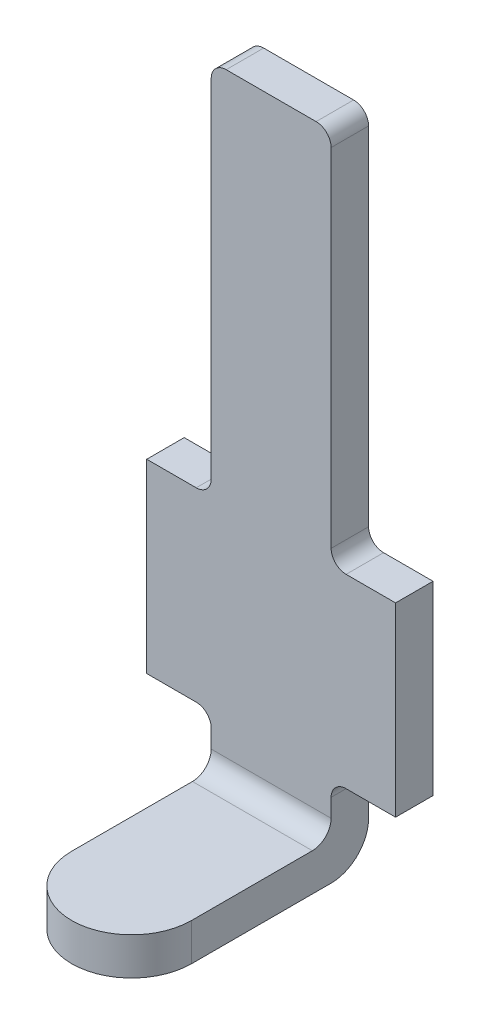
ISO-10303-21;
HEADER;
FILE_DESCRIPTION(('STEP AP214'),'2;1');
FILE_NAME('part.step','',(''),(''),'','','');
FILE_SCHEMA(('AUTOMOTIVE_DESIGN { 1 0 10303 214 1 1 1 1 }'));
ENDSEC;
DATA;
#1=APPLICATION_CONTEXT('core data for automotive mechanical design processes');
#2=APPLICATION_PROTOCOL_DEFINITION('international standard','automotive_design',2000,#1);
#3=PRODUCT_CONTEXT('',#1,'mechanical');
#4=PRODUCT('Part','Part','',(#3));
#5=PRODUCT_RELATED_PRODUCT_CATEGORY('part','',(#4));
#6=PRODUCT_DEFINITION_FORMATION('','',#4);
#7=PRODUCT_DEFINITION_CONTEXT('part definition',#1,'design');
#8=PRODUCT_DEFINITION('design','',#6,#7);
#9=PRODUCT_DEFINITION_SHAPE('','',#8);
#10=(LENGTH_UNIT() NAMED_UNIT(*) SI_UNIT(.MILLI.,.METRE.));
#11=(NAMED_UNIT(*) PLANE_ANGLE_UNIT() SI_UNIT($,.RADIAN.));
#12=(NAMED_UNIT(*) SI_UNIT($,.STERADIAN.) SOLID_ANGLE_UNIT());
#13=UNCERTAINTY_MEASURE_WITH_UNIT(LENGTH_MEASURE(1.E-05),#10,'distance_accuracy_value','');
#14=(GEOMETRIC_REPRESENTATION_CONTEXT(3) GLOBAL_UNCERTAINTY_ASSIGNED_CONTEXT((#13)) GLOBAL_UNIT_ASSIGNED_CONTEXT((#10,
#11,#12)) REPRESENTATION_CONTEXT('',''));
#15=CARTESIAN_POINT('',(0.,0.,0.));
#16=DIRECTION('',(0.,0.,1.));
#17=DIRECTION('',(1.,0.,0.));
#18=AXIS2_PLACEMENT_3D('',#15,#16,#17);
#19=CARTESIAN_POINT('',(10.93,1.48437551370885,0.748999999999983));
#20=DIRECTION('',(0.,0.,1.));
#21=DIRECTION('',(1.,0.,0.));
#22=AXIS2_PLACEMENT_3D('',#19,#20,#21);
#23=CYLINDRICAL_SURFACE('',#22,0.1);
#24=CARTESIAN_POINT('',(10.93,1.48437551370885,0.498999999999983));
#25=DIRECTION('',(0.,0.,1.));
#26=DIRECTION('',(1.,0.,0.));
#27=AXIS2_PLACEMENT_3D('',#24,#25,#26);
#28=CIRCLE('',#27,0.1);
#29=CARTESIAN_POINT('',(10.93,1.38437551370885,0.499000000000012));
#30=VERTEX_POINT('',#29);
#31=CARTESIAN_POINT('',(11.03,1.48437551370885,0.498999999999983));
#32=VERTEX_POINT('',#31);
#33=EDGE_CURVE('E331',#30,#32,#28,.T.);
#34=ORIENTED_EDGE('',*,*,#33,.F.);
#35=DIRECTION('',(0.,0.,-1.));
#36=VECTOR('',#35,1.);
#37=CARTESIAN_POINT('',(10.93,1.38437551370885,0.749000000000012));
#38=LINE('',#37,#36);
#39=CARTESIAN_POINT('',(10.93,1.38437551370885,0.749000000000012));
#40=VERTEX_POINT('',#39);
#41=EDGE_CURVE('E41',#40,#30,#38,.T.);
#42=ORIENTED_EDGE('',*,*,#41,.F.);
#43=CARTESIAN_POINT('',(10.93,1.48437551370885,0.748999999999983));
#44=DIRECTION('',(0.,0.,-1.));
#45=DIRECTION('',(-1.,0.,0.));
#46=AXIS2_PLACEMENT_3D('',#43,#44,#45);
#47=CIRCLE('',#46,0.1);
#48=CARTESIAN_POINT('',(11.03,1.48437551370885,0.748999999999983));
#49=VERTEX_POINT('',#48);
#50=EDGE_CURVE('E254',#49,#40,#47,.T.);
#51=ORIENTED_EDGE('',*,*,#50,.F.);
#52=DIRECTION('',(0.,0.,1.));
#53=VECTOR('',#52,1.);
#54=CARTESIAN_POINT('',(11.03,1.48437551370885,0.748999999999983));
#55=LINE('',#54,#53);
#56=EDGE_CURVE('E300',#32,#49,#55,.T.);
#57=ORIENTED_EDGE('',*,*,#56,.F.);
#58=EDGE_LOOP('',(#34,#42,#51,#57));
#59=FACE_BOUND('',#58,.T.);
#60=ADVANCED_FACE('F16',(#59),#23,.F.);
#61=CARTESIAN_POINT('',(11.93,1.48437551370885,0.749000000000014));
#62=DIRECTION('',(0.,0.,-1.));
#63=DIRECTION('',(-1.,0.,0.));
#64=AXIS2_PLACEMENT_3D('',#61,#62,#63);
#65=CYLINDRICAL_SURFACE('',#64,0.1);
#66=CARTESIAN_POINT('',(11.93,1.48437551370885,0.498999999999985));
#67=DIRECTION('',(0.,0.,1.));
#68=DIRECTION('',(1.,0.,0.));
#69=AXIS2_PLACEMENT_3D('',#66,#67,#68);
#70=CIRCLE('',#69,0.1);
#71=CARTESIAN_POINT('',(11.83,1.48437551370885,0.498999999999984));
#72=VERTEX_POINT('',#71);
#73=CARTESIAN_POINT('',(11.93,1.38437551370885,0.499000000000013));
#74=VERTEX_POINT('',#73);
#75=EDGE_CURVE('E275',#72,#74,#70,.T.);
#76=ORIENTED_EDGE('',*,*,#75,.F.);
#77=DIRECTION('',(0.,0.,-1.));
#78=VECTOR('',#77,1.);
#79=CARTESIAN_POINT('',(11.83,1.48437551370885,0.498999999999984));
#80=LINE('',#79,#78);
#81=CARTESIAN_POINT('',(11.83,1.48437551370885,0.748999999999984));
#82=VERTEX_POINT('',#81);
#83=EDGE_CURVE('E294',#82,#72,#80,.T.);
#84=ORIENTED_EDGE('',*,*,#83,.F.);
#85=CARTESIAN_POINT('',(11.93,1.48437551370885,0.748999999999984));
#86=DIRECTION('',(0.,0.,-1.));
#87=DIRECTION('',(-1.,0.,0.));
#88=AXIS2_PLACEMENT_3D('',#85,#86,#87);
#89=CIRCLE('',#88,0.1);
#90=CARTESIAN_POINT('',(11.93,1.38437551370885,0.749000000000014));
#91=VERTEX_POINT('',#90);
#92=EDGE_CURVE('E385',#91,#82,#89,.T.);
#93=ORIENTED_EDGE('',*,*,#92,.F.);
#94=DIRECTION('',(0.,0.,1.));
#95=VECTOR('',#94,1.);
#96=CARTESIAN_POINT('',(11.93,1.38437551370885,0.748999999999984));
#97=LINE('',#96,#95);
#98=EDGE_CURVE('E327',#74,#91,#97,.T.);
#99=ORIENTED_EDGE('',*,*,#98,.F.);
#100=EDGE_LOOP('',(#76,#84,#93,#99));
#101=FACE_BOUND('',#100,.T.);
#102=ADVANCED_FACE('F770',(#101),#65,.F.);
#103=CARTESIAN_POINT('',(10.93,0.0459658151929143,0.749000000000012));
#104=DIRECTION('',(0.,0.,-1.));
#105=DIRECTION('',(-1.,0.,0.));
#106=AXIS2_PLACEMENT_3D('',#103,#104,#105);
#107=CYLINDRICAL_SURFACE('',#106,0.1);
#108=CARTESIAN_POINT('',(10.93,0.0459658151929143,0.498999999999983));
#109=DIRECTION('',(0.,0.,1.));
#110=DIRECTION('',(1.,0.,0.));
#111=AXIS2_PLACEMENT_3D('',#108,#109,#110);
#112=CIRCLE('',#111,0.1);
#113=CARTESIAN_POINT('',(11.03,0.0459658151929143,0.498999999999983));
#114=VERTEX_POINT('',#113);
#115=CARTESIAN_POINT('',(10.93,0.145965815192914,0.499000000000012));
#116=VERTEX_POINT('',#115);
#117=EDGE_CURVE('E401',#114,#116,#112,.T.);
#118=ORIENTED_EDGE('',*,*,#117,.F.);
#119=DIRECTION('',(0.,0.,-1.));
#120=VECTOR('',#119,1.);
#121=CARTESIAN_POINT('',(11.03,0.0459658151929143,0.499000000000012));
#122=LINE('',#121,#120);
#123=CARTESIAN_POINT('',(11.03,0.0459658151929143,0.748999999999983));
#124=VERTEX_POINT('',#123);
#125=EDGE_CURVE('E88',#124,#114,#122,.T.);
#126=ORIENTED_EDGE('',*,*,#125,.F.);
#127=CARTESIAN_POINT('',(10.93,0.0459658151929143,0.748999999999983));
#128=DIRECTION('',(0.,0.,-1.));
#129=DIRECTION('',(-1.,0.,0.));
#130=AXIS2_PLACEMENT_3D('',#127,#128,#129);
#131=CIRCLE('',#130,0.1);
#132=CARTESIAN_POINT('',(10.93,0.145965815192914,0.749000000000012));
#133=VERTEX_POINT('',#132);
#134=EDGE_CURVE('E241',#133,#124,#131,.T.);
#135=ORIENTED_EDGE('',*,*,#134,.F.);
#136=DIRECTION('',(0.,0.,1.));
#137=VECTOR('',#136,1.);
#138=CARTESIAN_POINT('',(10.93,0.145965815192914,0.748999999999983));
#139=LINE('',#138,#137);
#140=EDGE_CURVE('E231',#116,#133,#139,.T.);
#141=ORIENTED_EDGE('',*,*,#140,.F.);
#142=EDGE_LOOP('',(#118,#126,#135,#141));
#143=FACE_BOUND('',#142,.T.);
#144=ADVANCED_FACE('F447',(#143),#107,.F.);
#145=CARTESIAN_POINT('',(11.93,0.0459658151929143,0.748999999999984));
#146=DIRECTION('',(0.,0.,1.));
#147=DIRECTION('',(1.,0.,0.));
#148=AXIS2_PLACEMENT_3D('',#145,#146,#147);
#149=CYLINDRICAL_SURFACE('',#148,0.1);
#150=CARTESIAN_POINT('',(11.93,0.0459658151929143,0.498999999999984));
#151=DIRECTION('',(0.,0.,1.));
#152=DIRECTION('',(1.,0.,0.));
#153=AXIS2_PLACEMENT_3D('',#150,#151,#152);
#154=CIRCLE('',#153,0.1);
#155=CARTESIAN_POINT('',(11.93,0.145965815192914,0.499000000000013));
#156=VERTEX_POINT('',#155);
#157=CARTESIAN_POINT('',(11.83,0.0459658151929143,0.498999999999984));
#158=VERTEX_POINT('',#157);
#159=EDGE_CURVE('E271',#156,#158,#154,.T.);
#160=ORIENTED_EDGE('',*,*,#159,.F.);
#161=DIRECTION('',(0.,0.,-1.));
#162=VECTOR('',#161,1.);
#163=CARTESIAN_POINT('',(11.93,0.145965815192914,0.749000000000013));
#164=LINE('',#163,#162);
#165=CARTESIAN_POINT('',(11.93,0.145965815192914,0.749000000000013));
#166=VERTEX_POINT('',#165);
#167=EDGE_CURVE('E26',#166,#156,#164,.T.);
#168=ORIENTED_EDGE('',*,*,#167,.F.);
#169=CARTESIAN_POINT('',(11.93,0.0459658151929143,0.748999999999984));
#170=DIRECTION('',(0.,0.,-1.));
#171=DIRECTION('',(-1.,0.,0.));
#172=AXIS2_PLACEMENT_3D('',#169,#170,#171);
#173=CIRCLE('',#172,0.1);
#174=CARTESIAN_POINT('',(11.83,0.0459658151929143,0.748999999999984));
#175=VERTEX_POINT('',#174);
#176=EDGE_CURVE('E310',#175,#166,#173,.T.);
#177=ORIENTED_EDGE('',*,*,#176,.F.);
#178=DIRECTION('',(0.,0.,1.));
#179=VECTOR('',#178,1.);
#180=CARTESIAN_POINT('',(11.83,0.0459658151929143,0.748999999999984));
#181=LINE('',#180,#179);
#182=EDGE_CURVE('E105',#158,#175,#181,.T.);
#183=ORIENTED_EDGE('',*,*,#182,.F.);
#184=EDGE_LOOP('',(#160,#168,#177,#183));
#185=FACE_BOUND('',#184,.T.);
#186=ADVANCED_FACE('F754',(#185),#149,.F.);
#187=CARTESIAN_POINT('',(11.13,3.8,0.748999999999983));
#188=DIRECTION('',(0.,0.,-1.));
#189=DIRECTION('',(-1.,0.,0.));
#190=AXIS2_PLACEMENT_3D('',#187,#188,#189);
#191=CYLINDRICAL_SURFACE('',#190,0.1);
#192=CARTESIAN_POINT('',(11.13,3.8,0.498999999999984));
#193=DIRECTION('',(0.,0.,-1.));
#194=DIRECTION('',(1.,0.,0.));
#195=AXIS2_PLACEMENT_3D('',#192,#193,#194);
#196=CIRCLE('',#195,0.1);
#197=CARTESIAN_POINT('',(11.03,3.8,0.498999999999984));
#198=VERTEX_POINT('',#197);
#199=CARTESIAN_POINT('',(11.13,3.9,0.498999999999984));
#200=VERTEX_POINT('',#199);
#201=EDGE_CURVE('E328',#198,#200,#196,.T.);
#202=ORIENTED_EDGE('',*,*,#201,.F.);
#203=DIRECTION('',(0.,0.,-1.));
#204=VECTOR('',#203,1.);
#205=CARTESIAN_POINT('',(11.03,3.8,0.498999999999984));
#206=LINE('',#205,#204);
#207=CARTESIAN_POINT('',(11.03,3.8,0.748999999999983));
#208=VERTEX_POINT('',#207);
#209=EDGE_CURVE('E346',#208,#198,#206,.T.);
#210=ORIENTED_EDGE('',*,*,#209,.F.);
#211=CARTESIAN_POINT('',(11.13,3.8,0.748999999999983));
#212=DIRECTION('',(0.,0.,1.));
#213=DIRECTION('',(-1.,0.,0.));
#214=AXIS2_PLACEMENT_3D('',#211,#212,#213);
#215=CIRCLE('',#214,0.1);
#216=CARTESIAN_POINT('',(11.13,3.9,0.748999999999983));
#217=VERTEX_POINT('',#216);
#218=EDGE_CURVE('E360',#217,#208,#215,.T.);
#219=ORIENTED_EDGE('',*,*,#218,.F.);
#220=DIRECTION('',(0.,0.,1.));
#221=VECTOR('',#220,1.);
#222=CARTESIAN_POINT('',(11.13,3.9,0.748999999999983));
#223=LINE('',#222,#221);
#224=EDGE_CURVE('E262',#200,#217,#223,.T.);
#225=ORIENTED_EDGE('',*,*,#224,.F.);
#226=EDGE_LOOP('',(#202,#210,#219,#225));
#227=FACE_BOUND('',#226,.T.);
#228=ADVANCED_FACE('F737',(#227),#191,.T.);
#229=CARTESIAN_POINT('',(11.73,3.8,0.748999999999984));
#230=DIRECTION('',(0.,0.,1.));
#231=DIRECTION('',(1.,0.,0.));
#232=AXIS2_PLACEMENT_3D('',#229,#230,#231);
#233=CYLINDRICAL_SURFACE('',#232,0.1);
#234=CARTESIAN_POINT('',(11.73,3.8,0.498999999999985));
#235=DIRECTION('',(0.,0.,-1.));
#236=DIRECTION('',(1.,0.,0.));
#237=AXIS2_PLACEMENT_3D('',#234,#235,#236);
#238=CIRCLE('',#237,0.1);
#239=CARTESIAN_POINT('',(11.73,3.9,0.498999999999985));
#240=VERTEX_POINT('',#239);
#241=CARTESIAN_POINT('',(11.83,3.8,0.498999999999985));
#242=VERTEX_POINT('',#241);
#243=EDGE_CURVE('E272',#240,#242,#238,.T.);
#244=ORIENTED_EDGE('',*,*,#243,.F.);
#245=DIRECTION('',(0.,0.,-1.));
#246=VECTOR('',#245,1.);
#247=CARTESIAN_POINT('',(11.73,3.9,0.748999999999984));
#248=LINE('',#247,#246);
#249=CARTESIAN_POINT('',(11.73,3.9,0.748999999999984));
#250=VERTEX_POINT('',#249);
#251=EDGE_CURVE('E283',#250,#240,#248,.T.);
#252=ORIENTED_EDGE('',*,*,#251,.F.);
#253=CARTESIAN_POINT('',(11.73,3.8,0.748999999999984));
#254=DIRECTION('',(0.,0.,1.));
#255=DIRECTION('',(-1.,0.,0.));
#256=AXIS2_PLACEMENT_3D('',#253,#254,#255);
#257=CIRCLE('',#256,0.1);
#258=CARTESIAN_POINT('',(11.83,3.8,0.748999999999984));
#259=VERTEX_POINT('',#258);
#260=EDGE_CURVE('E266',#259,#250,#257,.T.);
#261=ORIENTED_EDGE('',*,*,#260,.F.);
#262=DIRECTION('',(0.,0.,1.));
#263=VECTOR('',#262,1.);
#264=CARTESIAN_POINT('',(11.83,3.8,0.748999999999984));
#265=LINE('',#264,#263);
#266=EDGE_CURVE('E314',#242,#259,#265,.T.);
#267=ORIENTED_EDGE('',*,*,#266,.F.);
#268=EDGE_LOOP('',(#244,#252,#261,#267));
#269=FACE_BOUND('',#268,.T.);
#270=ADVANCED_FACE('F728',(#269),#233,.T.);
#271=CARTESIAN_POINT('',(12.26,0.,1.00308650274883E-13));
#272=DIRECTION('',(-1.,0.,0.));
#273=DIRECTION('',(0.,0.,1.));
#274=AXIS2_PLACEMENT_3D('',#271,#272,#273);
#275=PLANE('',#274);
#276=DIRECTION('',(0.,0.,-1.));
#277=VECTOR('',#276,1.);
#278=CARTESIAN_POINT('',(12.26,1.38437551370885,0.749000000000014));
#279=LINE('',#278,#277);
#280=CARTESIAN_POINT('',(12.26,1.38437551370885,0.749000000000014));
#281=VERTEX_POINT('',#280);
#282=CARTESIAN_POINT('',(12.26,1.38437551370885,0.499000000000014));
#283=VERTEX_POINT('',#282);
#284=EDGE_CURVE('E324',#281,#283,#279,.T.);
#285=ORIENTED_EDGE('',*,*,#284,.F.);
#286=DIRECTION('',(0.,-1.,0.));
#287=VECTOR('',#286,1.);
#288=CARTESIAN_POINT('',(12.26,1.38437551370885,0.749000000000014));
#289=LINE('',#288,#287);
#290=CARTESIAN_POINT('',(12.26,0.145965815192914,0.749000000000014));
#291=VERTEX_POINT('',#290);
#292=EDGE_CURVE('E309',#281,#291,#289,.T.);
#293=ORIENTED_EDGE('',*,*,#292,.T.);
#294=DIRECTION('',(0.,0.,-1.));
#295=VECTOR('',#294,1.);
#296=CARTESIAN_POINT('',(12.26,0.145965815192914,0.749000000000014));
#297=LINE('',#296,#295);
#298=CARTESIAN_POINT('',(12.26,0.145965815192914,0.499000000000014));
#299=VERTEX_POINT('',#298);
#300=EDGE_CURVE('E11',#291,#299,#297,.T.);
#301=ORIENTED_EDGE('',*,*,#300,.T.);
#302=DIRECTION('',(0.,-1.,0.));
#303=VECTOR('',#302,1.);
#304=CARTESIAN_POINT('',(12.26,1.38437551370885,0.499000000000014));
#305=LINE('',#304,#303);
#306=EDGE_CURVE('E277',#283,#299,#305,.T.);
#307=ORIENTED_EDGE('',*,*,#306,.F.);
#308=EDGE_LOOP('',(#285,#293,#301,#307));
#309=FACE_BOUND('',#308,.T.);
#310=ADVANCED_FACE('F616',(#309),#275,.F.);
#311=CARTESIAN_POINT('',(10.6,0.145965815192914,0.749000000000011));
#312=DIRECTION('',(0.,-1.,0.));
#313=DIRECTION('',(0.,0.,-1.));
#314=AXIS2_PLACEMENT_3D('',#311,#312,#313);
#315=PLANE('',#314);
#316=DIRECTION('',(1.,0.,0.));
#317=VECTOR('',#316,1.);
#318=CARTESIAN_POINT('',(10.6,0.145965815192914,0.749000000000011));
#319=LINE('',#318,#317);
#320=EDGE_CURVE('E305',#166,#291,#319,.T.);
#321=ORIENTED_EDGE('',*,*,#320,.F.);
#322=ORIENTED_EDGE('',*,*,#167,.T.);
#323=DIRECTION('',(1.,0.,0.));
#324=VECTOR('',#323,1.);
#325=CARTESIAN_POINT('',(10.6,0.145965815192914,0.499000000000011));
#326=LINE('',#325,#324);
#327=EDGE_CURVE('E280',#156,#299,#326,.T.);
#328=ORIENTED_EDGE('',*,*,#327,.T.);
#329=ORIENTED_EDGE('',*,*,#300,.F.);
#330=EDGE_LOOP('',(#321,#322,#328,#329));
#331=FACE_BOUND('',#330,.T.);
#332=ADVANCED_FACE('F611',(#331),#315,.T.);
#333=CARTESIAN_POINT('',(10.6,1.38437551370885,0.749000000000012));
#334=DIRECTION('',(0.,-1.,0.));
#335=DIRECTION('',(0.,0.,-1.));
#336=AXIS2_PLACEMENT_3D('',#333,#334,#335);
#337=PLANE('',#336);
#338=DIRECTION('',(1.,0.,0.));
#339=VECTOR('',#338,1.);
#340=CARTESIAN_POINT('',(10.6,1.38437551370885,0.499000000000011));
#341=LINE('',#340,#339);
#342=EDGE_CURVE('E281',#74,#283,#341,.T.);
#343=ORIENTED_EDGE('',*,*,#342,.F.);
#344=ORIENTED_EDGE('',*,*,#98,.T.);
#345=DIRECTION('',(1.,0.,0.));
#346=VECTOR('',#345,1.);
#347=CARTESIAN_POINT('',(10.6,1.38437551370885,0.749000000000012));
#348=LINE('',#347,#346);
#349=EDGE_CURVE('E388',#91,#281,#348,.T.);
#350=ORIENTED_EDGE('',*,*,#349,.T.);
#351=ORIENTED_EDGE('',*,*,#284,.T.);
#352=EDGE_LOOP('',(#343,#344,#350,#351));
#353=FACE_BOUND('',#352,.T.);
#354=ADVANCED_FACE('F615',(#353),#337,.F.);
#355=CARTESIAN_POINT('',(10.6,1.38437551370885,0.749000000000012));
#356=DIRECTION('',(0.,-1.,0.));
#357=DIRECTION('',(0.,0.,-1.));
#358=AXIS2_PLACEMENT_3D('',#355,#356,#357);
#359=PLANE('',#358);
#360=DIRECTION('',(1.,0.,0.));
#361=VECTOR('',#360,1.);
#362=CARTESIAN_POINT('',(10.6,1.38437551370885,0.749000000000012));
#363=LINE('',#362,#361);
#364=CARTESIAN_POINT('',(10.6,1.38437551370885,0.749000000000012));
#365=VERTEX_POINT('',#364);
#366=EDGE_CURVE('E246',#365,#40,#363,.T.);
#367=ORIENTED_EDGE('',*,*,#366,.T.);
#368=ORIENTED_EDGE('',*,*,#41,.T.);
#369=DIRECTION('',(1.,0.,0.));
#370=VECTOR('',#369,1.);
#371=CARTESIAN_POINT('',(10.6,1.38437551370885,0.499000000000011));
#372=LINE('',#371,#370);
#373=CARTESIAN_POINT('',(10.6,1.38437551370885,0.499000000000011));
#374=VERTEX_POINT('',#373);
#375=EDGE_CURVE('E339',#374,#30,#372,.T.);
#376=ORIENTED_EDGE('',*,*,#375,.F.);
#377=DIRECTION('',(0.,0.,-1.));
#378=VECTOR('',#377,1.);
#379=CARTESIAN_POINT('',(10.6,1.38437551370885,0.749000000000012));
#380=LINE('',#379,#378);
#381=EDGE_CURVE('E232',#365,#374,#380,.T.);
#382=ORIENTED_EDGE('',*,*,#381,.F.);
#383=EDGE_LOOP('',(#367,#368,#376,#382));
#384=FACE_BOUND('',#383,.T.);
#385=ADVANCED_FACE('F702',(#384),#359,.F.);
#386=CARTESIAN_POINT('',(10.6,0.145965815192914,0.749000000000011));
#387=DIRECTION('',(0.,-1.,0.));
#388=DIRECTION('',(0.,0.,-1.));
#389=AXIS2_PLACEMENT_3D('',#386,#387,#388);
#390=PLANE('',#389);
#391=DIRECTION('',(1.,0.,0.));
#392=VECTOR('',#391,1.);
#393=CARTESIAN_POINT('',(10.6,0.145965815192914,0.499000000000011));
#394=LINE('',#393,#392);
#395=CARTESIAN_POINT('',(10.6,0.145965815192914,0.499000000000011));
#396=VERTEX_POINT('',#395);
#397=EDGE_CURVE('E396',#396,#116,#394,.T.);
#398=ORIENTED_EDGE('',*,*,#397,.T.);
#399=ORIENTED_EDGE('',*,*,#140,.T.);
#400=DIRECTION('',(1.,0.,0.));
#401=VECTOR('',#400,1.);
#402=CARTESIAN_POINT('',(10.6,0.145965815192914,0.749000000000011));
#403=LINE('',#402,#401);
#404=CARTESIAN_POINT('',(10.6,0.145965815192914,0.749000000000011));
#405=VERTEX_POINT('',#404);
#406=EDGE_CURVE('E235',#405,#133,#403,.T.);
#407=ORIENTED_EDGE('',*,*,#406,.F.);
#408=DIRECTION('',(0.,0.,-1.));
#409=VECTOR('',#408,1.);
#410=CARTESIAN_POINT('',(10.6,0.145965815192914,0.749000000000011));
#411=LINE('',#410,#409);
#412=EDGE_CURVE('E219',#405,#396,#411,.T.);
#413=ORIENTED_EDGE('',*,*,#412,.T.);
#414=EDGE_LOOP('',(#398,#399,#407,#413));
#415=FACE_BOUND('',#414,.T.);
#416=ADVANCED_FACE('F236',(#415),#390,.T.);
#417=CARTESIAN_POINT('',(10.6,0.,0.));
#418=DIRECTION('',(-1.,0.,0.));
#419=DIRECTION('',(0.,0.,1.));
#420=AXIS2_PLACEMENT_3D('',#417,#418,#419);
#421=PLANE('',#420);
#422=ORIENTED_EDGE('',*,*,#381,.T.);
#423=DIRECTION('',(0.,-1.,0.));
#424=VECTOR('',#423,1.);
#425=CARTESIAN_POINT('',(10.6,1.38437551370885,0.499000000000011));
#426=LINE('',#425,#424);
#427=EDGE_CURVE('E226',#374,#396,#426,.T.);
#428=ORIENTED_EDGE('',*,*,#427,.T.);
#429=ORIENTED_EDGE('',*,*,#412,.F.);
#430=DIRECTION('',(0.,-1.,0.));
#431=VECTOR('',#430,1.);
#432=CARTESIAN_POINT('',(10.6,1.38437551370885,0.749000000000012));
#433=LINE('',#432,#431);
#434=EDGE_CURVE('E223',#365,#405,#433,.T.);
#435=ORIENTED_EDGE('',*,*,#434,.F.);
#436=EDGE_LOOP('',(#422,#428,#429,#435));
#437=FACE_BOUND('',#436,.T.);
#438=ADVANCED_FACE('F221',(#437),#421,.T.);
#439=CARTESIAN_POINT('',(11.43,-0.2,1.68));
#440=DIRECTION('',(0.,-1.,0.));
#441=DIRECTION('',(0.,0.,-1.));
#442=AXIS2_PLACEMENT_3D('',#439,#440,#441);
#443=CYLINDRICAL_SURFACE('',#442,0.4);
#444=DIRECTION('',(0.,-1.,0.));
#445=VECTOR('',#444,1.);
#446=CARTESIAN_POINT('',(11.83,-0.2,1.68));
#447=LINE('',#446,#445);
#448=CARTESIAN_POINT('',(11.83,-0.2,1.68));
#449=VERTEX_POINT('',#448);
#450=CARTESIAN_POINT('',(11.83,-0.45,1.68));
#451=VERTEX_POINT('',#450);
#452=EDGE_CURVE('E377',#449,#451,#447,.T.);
#453=ORIENTED_EDGE('',*,*,#452,.F.);
#454=CARTESIAN_POINT('',(11.43,-0.2,1.68));
#455=DIRECTION('',(0.,1.,0.));
#456=DIRECTION('',(0.,0.,-1.));
#457=AXIS2_PLACEMENT_3D('',#454,#455,#456);
#458=CIRCLE('',#457,0.4);
#459=CARTESIAN_POINT('',(11.03,-0.2,1.68));
#460=VERTEX_POINT('',#459);
#461=EDGE_CURVE('E292',#460,#449,#458,.T.);
#462=ORIENTED_EDGE('',*,*,#461,.F.);
#463=DIRECTION('',(0.,1.,0.));
#464=VECTOR('',#463,1.);
#465=CARTESIAN_POINT('',(11.03,-0.2,1.68));
#466=LINE('',#465,#464);
#467=CARTESIAN_POINT('',(11.03,-0.45,1.68));
#468=VERTEX_POINT('',#467);
#469=EDGE_CURVE('E261',#468,#460,#466,.T.);
#470=ORIENTED_EDGE('',*,*,#469,.F.);
#471=CARTESIAN_POINT('',(11.43,-0.45,1.68));
#472=DIRECTION('',(0.,-1.,0.));
#473=DIRECTION('',(0.,0.,1.));
#474=AXIS2_PLACEMENT_3D('',#471,#472,#473);
#475=CIRCLE('',#474,0.4);
#476=EDGE_CURVE('E352',#451,#468,#475,.T.);
#477=ORIENTED_EDGE('',*,*,#476,.F.);
#478=EDGE_LOOP('',(#453,#462,#470,#477));
#479=FACE_BOUND('',#478,.T.);
#480=ADVANCED_FACE('F482',(#479),#443,.T.);
#481=CARTESIAN_POINT('',(11.03,-0.2,0.748999999999983));
#482=DIRECTION('',(-1.,0.,0.));
#483=DIRECTION('',(0.,0.,1.));
#484=AXIS2_PLACEMENT_3D('',#481,#482,#483);
#485=PLANE('',#484);
#486=DIRECTION('',(0.,-1.,0.));
#487=VECTOR('',#486,1.);
#488=CARTESIAN_POINT('',(11.03,3.9,0.748999999999983));
#489=LINE('',#488,#487);
#490=CARTESIAN_POINT('',(11.03,-0.0749999999999988,0.748999999999983));
#491=VERTEX_POINT('',#490);
#492=EDGE_CURVE('E353',#124,#491,#489,.T.);
#493=ORIENTED_EDGE('',*,*,#492,.F.);
#494=ORIENTED_EDGE('',*,*,#125,.T.);
#495=DIRECTION('',(0.,1.,0.));
#496=VECTOR('',#495,1.);
#497=CARTESIAN_POINT('',(11.03,3.9,0.498999999999984));
#498=LINE('',#497,#496);
#499=CARTESIAN_POINT('',(11.03,-0.2,0.498999999999983));
#500=VERTEX_POINT('',#499);
#501=EDGE_CURVE('E19',#500,#114,#498,.T.);
#502=ORIENTED_EDGE('',*,*,#501,.F.);
#503=CARTESIAN_POINT('',(11.03,-0.2,0.748999999999983));
#504=DIRECTION('',(1.,0.,0.));
#505=DIRECTION('',(0.,0.,1.));
#506=AXIS2_PLACEMENT_3D('',#503,#504,#505);
#507=CIRCLE('',#506,0.25);
#508=CARTESIAN_POINT('',(11.03,-0.45,0.748999999999983));
#509=VERTEX_POINT('',#508);
#510=EDGE_CURVE('E323',#509,#500,#507,.T.);
#511=ORIENTED_EDGE('',*,*,#510,.F.);
#512=DIRECTION('',(0.,0.,-1.));
#513=VECTOR('',#512,1.);
#514=CARTESIAN_POINT('',(11.03,-0.45,0.748999999999983));
#515=LINE('',#514,#513);
#516=EDGE_CURVE('E347',#468,#509,#515,.T.);
#517=ORIENTED_EDGE('',*,*,#516,.F.);
#518=ORIENTED_EDGE('',*,*,#469,.T.);
#519=DIRECTION('',(0.,0.,1.));
#520=VECTOR('',#519,1.);
#521=CARTESIAN_POINT('',(11.03,-0.2,0.873999999999983));
#522=LINE('',#521,#520);
#523=CARTESIAN_POINT('',(11.03,-0.2,0.873999999999983));
#524=VERTEX_POINT('',#523);
#525=EDGE_CURVE('E288',#524,#460,#522,.T.);
#526=ORIENTED_EDGE('',*,*,#525,.F.);
#527=CARTESIAN_POINT('',(11.03,-0.0749999999999988,0.873999999999983));
#528=DIRECTION('',(-1.,0.,0.));
#529=DIRECTION('',(0.,0.,1.));
#530=AXIS2_PLACEMENT_3D('',#527,#528,#529);
#531=CIRCLE('',#530,0.125);
#532=EDGE_CURVE('E381',#491,#524,#531,.T.);
#533=ORIENTED_EDGE('',*,*,#532,.F.);
#534=EDGE_LOOP('',(#493,#494,#502,#511,#517,#518,#526,#533));
#535=FACE_BOUND('',#534,.T.);
#536=ADVANCED_FACE('F449',(#535),#485,.T.);
#537=CARTESIAN_POINT('',(11.83,-0.2,0.748999999999984));
#538=DIRECTION('',(-1.,0.,0.));
#539=DIRECTION('',(0.,0.,1.));
#540=AXIS2_PLACEMENT_3D('',#537,#538,#539);
#541=PLANE('',#540);
#542=DIRECTION('',(0.,1.,0.));
#543=VECTOR('',#542,1.);
#544=CARTESIAN_POINT('',(11.83,3.9,0.498999999999985));
#545=LINE('',#544,#543);
#546=CARTESIAN_POINT('',(11.83,-0.2,0.498999999999984));
#547=VERTEX_POINT('',#546);
#548=EDGE_CURVE('E268',#547,#158,#545,.T.);
#549=ORIENTED_EDGE('',*,*,#548,.T.);
#550=ORIENTED_EDGE('',*,*,#182,.T.);
#551=DIRECTION('',(0.,-1.,0.));
#552=VECTOR('',#551,1.);
#553=CARTESIAN_POINT('',(11.83,3.9,0.748999999999984));
#554=LINE('',#553,#552);
#555=CARTESIAN_POINT('',(11.83,-0.0749999999999988,0.748999999999984));
#556=VERTEX_POINT('',#555);
#557=EDGE_CURVE('E368',#175,#556,#554,.T.);
#558=ORIENTED_EDGE('',*,*,#557,.T.);
#559=CARTESIAN_POINT('',(11.83,-0.0749999999999988,0.873999999999984));
#560=DIRECTION('',(-1.,0.,0.));
#561=DIRECTION('',(0.,0.,1.));
#562=AXIS2_PLACEMENT_3D('',#559,#560,#561);
#563=CIRCLE('',#562,0.125);
#564=CARTESIAN_POINT('',(11.83,-0.2,0.873999999999984));
#565=VERTEX_POINT('',#564);
#566=EDGE_CURVE('E293',#556,#565,#563,.T.);
#567=ORIENTED_EDGE('',*,*,#566,.T.);
#568=DIRECTION('',(0.,0.,1.));
#569=VECTOR('',#568,1.);
#570=CARTESIAN_POINT('',(11.83,-0.2,0.873999999999984));
#571=LINE('',#570,#569);
#572=EDGE_CURVE('E370',#565,#449,#571,.T.);
#573=ORIENTED_EDGE('',*,*,#572,.T.);
#574=ORIENTED_EDGE('',*,*,#452,.T.);
#575=DIRECTION('',(0.,0.,-1.));
#576=VECTOR('',#575,1.);
#577=CARTESIAN_POINT('',(11.83,-0.45,0.748999999999984));
#578=LINE('',#577,#576);
#579=CARTESIAN_POINT('',(11.83,-0.45,0.748999999999984));
#580=VERTEX_POINT('',#579);
#581=EDGE_CURVE('E389',#451,#580,#578,.T.);
#582=ORIENTED_EDGE('',*,*,#581,.T.);
#583=CARTESIAN_POINT('',(11.83,-0.2,0.748999999999984));
#584=DIRECTION('',(1.,0.,0.));
#585=DIRECTION('',(0.,0.,1.));
#586=AXIS2_PLACEMENT_3D('',#583,#584,#585);
#587=CIRCLE('',#586,0.25);
#588=EDGE_CURVE('E276',#580,#547,#587,.T.);
#589=ORIENTED_EDGE('',*,*,#588,.T.);
#590=EDGE_LOOP('',(#549,#550,#558,#567,#573,#574,#582,#589));
#591=FACE_BOUND('',#590,.T.);
#592=ADVANCED_FACE('F487',(#591),#541,.F.);
#593=CARTESIAN_POINT('',(11.83,3.9,0.498999999999985));
#594=DIRECTION('',(0.,0.,1.));
#595=DIRECTION('',(1.,0.,0.));
#596=AXIS2_PLACEMENT_3D('',#593,#594,#595);
#597=PLANE('',#596);
#598=DIRECTION('',(-1.,0.,0.));
#599=VECTOR('',#598,1.);
#600=CARTESIAN_POINT('',(11.83,3.9,0.498999999999985));
#601=LINE('',#600,#599);
#602=EDGE_CURVE('E267',#240,#200,#601,.T.);
#603=ORIENTED_EDGE('',*,*,#602,.F.);
#604=ORIENTED_EDGE('',*,*,#243,.T.);
#605=DIRECTION('',(0.,1.,0.));
#606=VECTOR('',#605,1.);
#607=CARTESIAN_POINT('',(11.83,3.9,0.498999999999985));
#608=LINE('',#607,#606);
#609=EDGE_CURVE('E318',#72,#242,#608,.T.);
#610=ORIENTED_EDGE('',*,*,#609,.F.);
#611=ORIENTED_EDGE('',*,*,#75,.T.);
#612=ORIENTED_EDGE('',*,*,#342,.T.);
#613=ORIENTED_EDGE('',*,*,#306,.T.);
#614=ORIENTED_EDGE('',*,*,#327,.F.);
#615=ORIENTED_EDGE('',*,*,#159,.T.);
#616=ORIENTED_EDGE('',*,*,#548,.F.);
#617=DIRECTION('',(-1.,0.,0.));
#618=VECTOR('',#617,1.);
#619=CARTESIAN_POINT('',(11.83,-0.2,0.498999999999984));
#620=LINE('',#619,#618);
#621=EDGE_CURVE('E319',#547,#500,#620,.T.);
#622=ORIENTED_EDGE('',*,*,#621,.T.);
#623=ORIENTED_EDGE('',*,*,#501,.T.);
#624=ORIENTED_EDGE('',*,*,#117,.T.);
#625=ORIENTED_EDGE('',*,*,#397,.F.);
#626=ORIENTED_EDGE('',*,*,#427,.F.);
#627=ORIENTED_EDGE('',*,*,#375,.T.);
#628=ORIENTED_EDGE('',*,*,#33,.T.);
#629=DIRECTION('',(0.,1.,0.));
#630=VECTOR('',#629,1.);
#631=CARTESIAN_POINT('',(11.03,3.9,0.498999999999984));
#632=LINE('',#631,#630);
#633=EDGE_CURVE('E304',#32,#198,#632,.T.);
#634=ORIENTED_EDGE('',*,*,#633,.T.);
#635=ORIENTED_EDGE('',*,*,#201,.T.);
#636=EDGE_LOOP('',(#603,#604,#610,#611,#612,#613,#614,#615,#616,#622,#623,#624,#625,#626,#627,
#628,#634,#635));
#637=FACE_BOUND('',#636,.T.);
#638=ADVANCED_FACE('F649',(#637),#597,.F.);
#639=CARTESIAN_POINT('',(11.83,-0.2,0.748999999999984));
#640=DIRECTION('',(-1.,0.,0.));
#641=DIRECTION('',(0.,0.,1.));
#642=AXIS2_PLACEMENT_3D('',#639,#640,#641);
#643=CYLINDRICAL_SURFACE('',#642,0.25);
#644=ORIENTED_EDGE('',*,*,#510,.T.);
#645=ORIENTED_EDGE('',*,*,#621,.F.);
#646=ORIENTED_EDGE('',*,*,#588,.F.);
#647=DIRECTION('',(-1.,0.,0.));
#648=VECTOR('',#647,1.);
#649=CARTESIAN_POINT('',(11.83,-0.45,0.748999999999984));
#650=LINE('',#649,#648);
#651=EDGE_CURVE('E351',#580,#509,#650,.T.);
#652=ORIENTED_EDGE('',*,*,#651,.T.);
#653=EDGE_LOOP('',(#644,#645,#646,#652));
#654=FACE_BOUND('',#653,.T.);
#655=ADVANCED_FACE('F633',(#654),#643,.T.);
#656=CARTESIAN_POINT('',(11.83,-0.45,0.748999999999984));
#657=DIRECTION('',(0.,1.,0.));
#658=DIRECTION('',(0.,0.,-1.));
#659=AXIS2_PLACEMENT_3D('',#656,#657,#658);
#660=PLANE('',#659);
#661=ORIENTED_EDGE('',*,*,#476,.T.);
#662=ORIENTED_EDGE('',*,*,#516,.T.);
#663=ORIENTED_EDGE('',*,*,#651,.F.);
#664=ORIENTED_EDGE('',*,*,#581,.F.);
#665=EDGE_LOOP('',(#661,#662,#663,#664));
#666=FACE_BOUND('',#665,.T.);
#667=ADVANCED_FACE('F625',(#666),#660,.F.);
#668=CARTESIAN_POINT('',(11.83,-0.2,0.873999999999984));
#669=DIRECTION('',(0.,-1.,0.));
#670=DIRECTION('',(0.,0.,-1.));
#671=AXIS2_PLACEMENT_3D('',#668,#669,#670);
#672=PLANE('',#671);
#673=ORIENTED_EDGE('',*,*,#525,.T.);
#674=ORIENTED_EDGE('',*,*,#461,.T.);
#675=ORIENTED_EDGE('',*,*,#572,.F.);
#676=DIRECTION('',(-1.,0.,0.));
#677=VECTOR('',#676,1.);
#678=CARTESIAN_POINT('',(11.83,-0.2,0.873999999999984));
#679=LINE('',#678,#677);
#680=EDGE_CURVE('E258',#565,#524,#679,.T.);
#681=ORIENTED_EDGE('',*,*,#680,.T.);
#682=EDGE_LOOP('',(#673,#674,#675,#681));
#683=FACE_BOUND('',#682,.T.);
#684=ADVANCED_FACE('F480',(#683),#672,.F.);
#685=CARTESIAN_POINT('',(11.83,-0.0749999999999988,0.873999999999984));
#686=DIRECTION('',(-1.,0.,0.));
#687=DIRECTION('',(0.,0.,1.));
#688=AXIS2_PLACEMENT_3D('',#685,#686,#687);
#689=CYLINDRICAL_SURFACE('',#688,0.125);
#690=ORIENTED_EDGE('',*,*,#532,.T.);
#691=ORIENTED_EDGE('',*,*,#680,.F.);
#692=ORIENTED_EDGE('',*,*,#566,.F.);
#693=DIRECTION('',(-1.,0.,0.));
#694=VECTOR('',#693,1.);
#695=CARTESIAN_POINT('',(11.83,-0.0749999999999988,0.748999999999984));
#696=LINE('',#695,#694);
#697=EDGE_CURVE('E357',#556,#491,#696,.T.);
#698=ORIENTED_EDGE('',*,*,#697,.T.);
#699=EDGE_LOOP('',(#690,#691,#692,#698));
#700=FACE_BOUND('',#699,.T.);
#701=ADVANCED_FACE('F454',(#700),#689,.F.);
#702=CARTESIAN_POINT('',(11.83,3.9,0.748999999999984));
#703=DIRECTION('',(0.,0.,-1.));
#704=DIRECTION('',(0.,-1.,0.));
#705=AXIS2_PLACEMENT_3D('',#702,#703,#704);
#706=PLANE('',#705);
#707=DIRECTION('',(0.,-1.,0.));
#708=VECTOR('',#707,1.);
#709=CARTESIAN_POINT('',(11.83,3.9,0.748999999999984));
#710=LINE('',#709,#708);
#711=EDGE_CURVE('E299',#259,#82,#710,.T.);
#712=ORIENTED_EDGE('',*,*,#711,.F.);
#713=ORIENTED_EDGE('',*,*,#260,.T.);
#714=DIRECTION('',(-1.,0.,0.));
#715=VECTOR('',#714,1.);
#716=CARTESIAN_POINT('',(11.83,3.9,0.748999999999984));
#717=LINE('',#716,#715);
#718=EDGE_CURVE('E287',#250,#217,#717,.T.);
#719=ORIENTED_EDGE('',*,*,#718,.T.);
#720=ORIENTED_EDGE('',*,*,#218,.T.);
#721=DIRECTION('',(0.,-1.,0.));
#722=VECTOR('',#721,1.);
#723=CARTESIAN_POINT('',(11.03,3.9,0.748999999999983));
#724=LINE('',#723,#722);
#725=EDGE_CURVE('E298',#208,#49,#724,.T.);
#726=ORIENTED_EDGE('',*,*,#725,.T.);
#727=ORIENTED_EDGE('',*,*,#50,.T.);
#728=ORIENTED_EDGE('',*,*,#366,.F.);
#729=ORIENTED_EDGE('',*,*,#434,.T.);
#730=ORIENTED_EDGE('',*,*,#406,.T.);
#731=ORIENTED_EDGE('',*,*,#134,.T.);
#732=ORIENTED_EDGE('',*,*,#492,.T.);
#733=ORIENTED_EDGE('',*,*,#697,.F.);
#734=ORIENTED_EDGE('',*,*,#557,.F.);
#735=ORIENTED_EDGE('',*,*,#176,.T.);
#736=ORIENTED_EDGE('',*,*,#320,.T.);
#737=ORIENTED_EDGE('',*,*,#292,.F.);
#738=ORIENTED_EDGE('',*,*,#349,.F.);
#739=ORIENTED_EDGE('',*,*,#92,.T.);
#740=EDGE_LOOP('',(#712,#713,#719,#720,#726,#727,#728,#729,#730,#731,#732,#733,#734,#735,#736,
#737,#738,#739));
#741=FACE_BOUND('',#740,.T.);
#742=ADVANCED_FACE('F244',(#741),#706,.F.);
#743=CARTESIAN_POINT('',(11.83,3.9,0.748999999999984));
#744=DIRECTION('',(0.,-1.,0.));
#745=DIRECTION('',(0.,0.,-1.));
#746=AXIS2_PLACEMENT_3D('',#743,#744,#745);
#747=PLANE('',#746);
#748=ORIENTED_EDGE('',*,*,#718,.F.);
#749=ORIENTED_EDGE('',*,*,#251,.T.);
#750=ORIENTED_EDGE('',*,*,#602,.T.);
#751=ORIENTED_EDGE('',*,*,#224,.T.);
#752=EDGE_LOOP('',(#748,#749,#750,#751));
#753=FACE_BOUND('',#752,.T.);
#754=ADVANCED_FACE('F657',(#753),#747,.F.);
#755=CARTESIAN_POINT('',(11.03,-0.2,0.748999999999983));
#756=DIRECTION('',(-1.,0.,0.));
#757=DIRECTION('',(0.,0.,1.));
#758=AXIS2_PLACEMENT_3D('',#755,#756,#757);
#759=PLANE('',#758);
#760=ORIENTED_EDGE('',*,*,#725,.F.);
#761=ORIENTED_EDGE('',*,*,#209,.T.);
#762=ORIENTED_EDGE('',*,*,#633,.F.);
#763=ORIENTED_EDGE('',*,*,#56,.T.);
#764=EDGE_LOOP('',(#760,#761,#762,#763));
#765=FACE_BOUND('',#764,.T.);
#766=ADVANCED_FACE('F711',(#765),#759,.T.);
#767=CARTESIAN_POINT('',(11.83,-0.2,0.748999999999984));
#768=DIRECTION('',(-1.,0.,0.));
#769=DIRECTION('',(0.,0.,1.));
#770=AXIS2_PLACEMENT_3D('',#767,#768,#769);
#771=PLANE('',#770);
#772=ORIENTED_EDGE('',*,*,#609,.T.);
#773=ORIENTED_EDGE('',*,*,#266,.T.);
#774=ORIENTED_EDGE('',*,*,#711,.T.);
#775=ORIENTED_EDGE('',*,*,#83,.T.);
#776=EDGE_LOOP('',(#772,#773,#774,#775));
#777=FACE_BOUND('',#776,.T.);
#778=ADVANCED_FACE('F707',(#777),#771,.F.);
#779=CLOSED_SHELL('',(#60,#102,#144,#186,#228,#270,#310,#332,#354,#385,#416,#438,#480,#536,#592,
#638,#655,#667,#684,#701,#742,#754,#766,#778));
#780=MANIFOLD_SOLID_BREP('B1',#779);
#781=ADVANCED_BREP_SHAPE_REPRESENTATION('',(#18,#780),#14);
#782=SHAPE_DEFINITION_REPRESENTATION(#9,#781);
ENDSEC;
END-ISO-10303-21;
